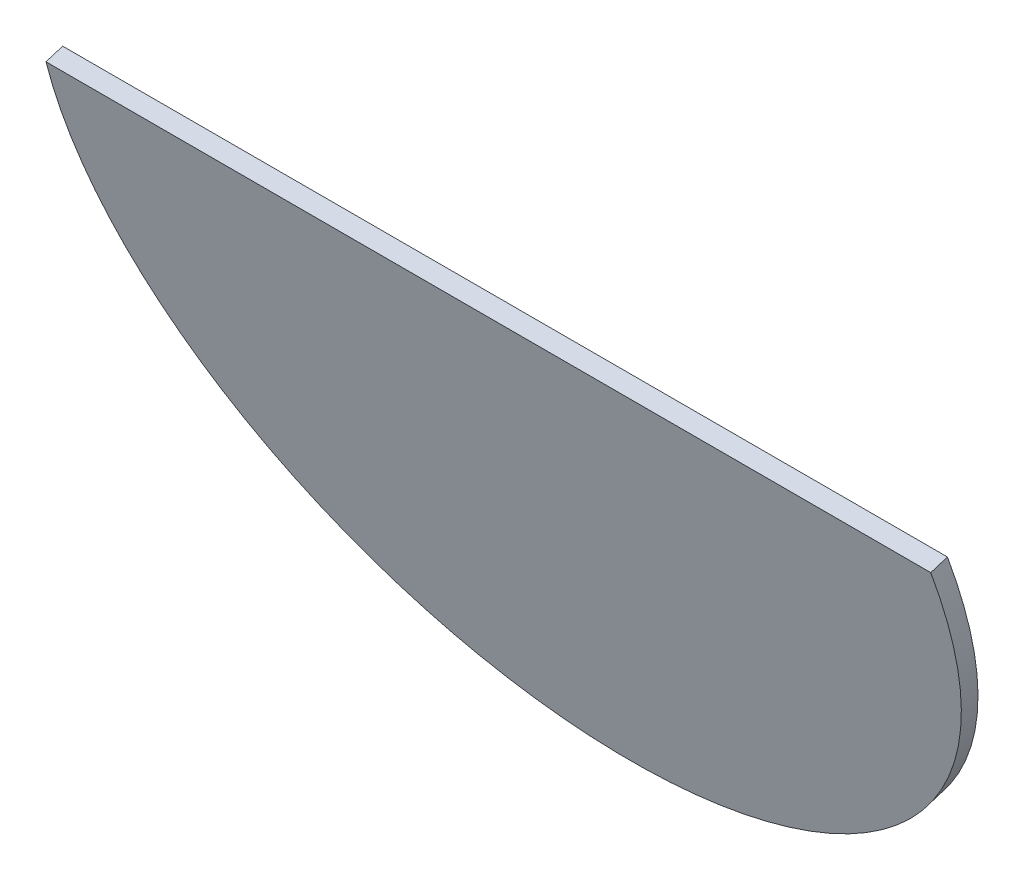
ISO-10303-21;
HEADER;
FILE_DESCRIPTION(('STEP AP214'),'2;1');
FILE_NAME('part.step','',(''),(''),'','','');
FILE_SCHEMA(('AUTOMOTIVE_DESIGN { 1 0 10303 214 1 1 1 1 }'));
ENDSEC;
DATA;
#1=APPLICATION_CONTEXT('core data for automotive mechanical design processes');
#2=APPLICATION_PROTOCOL_DEFINITION('international standard','automotive_design',2000,#1);
#3=PRODUCT_CONTEXT('',#1,'mechanical');
#4=PRODUCT('Part','Part','',(#3));
#5=PRODUCT_RELATED_PRODUCT_CATEGORY('part','',(#4));
#6=PRODUCT_DEFINITION_FORMATION('','',#4);
#7=PRODUCT_DEFINITION_CONTEXT('part definition',#1,'design');
#8=PRODUCT_DEFINITION('design','',#6,#7);
#9=PRODUCT_DEFINITION_SHAPE('','',#8);
#10=(LENGTH_UNIT() NAMED_UNIT(*) SI_UNIT(.MILLI.,.METRE.));
#11=(NAMED_UNIT(*) PLANE_ANGLE_UNIT() SI_UNIT($,.RADIAN.));
#12=(NAMED_UNIT(*) SI_UNIT($,.STERADIAN.) SOLID_ANGLE_UNIT());
#13=UNCERTAINTY_MEASURE_WITH_UNIT(LENGTH_MEASURE(1.E-05),#10,'distance_accuracy_value','');
#14=(GEOMETRIC_REPRESENTATION_CONTEXT(3) GLOBAL_UNCERTAINTY_ASSIGNED_CONTEXT((#13)) GLOBAL_UNIT_ASSIGNED_CONTEXT((#10,
#11,#12)) REPRESENTATION_CONTEXT('',''));
#15=CARTESIAN_POINT('',(0.,0.,0.));
#16=DIRECTION('',(0.,0.,1.));
#17=DIRECTION('',(1.,0.,0.));
#18=AXIS2_PLACEMENT_3D('',#15,#16,#17);
#19=CARTESIAN_POINT('',(95.5179,-317.703250931976,33.0611022683727));
#20=DIRECTION('',(0.,-0.298374534012254,0.954448865813654));
#21=DIRECTION('',(0.,-0.954448865813654,-0.298374534012254));
#22=AXIS2_PLACEMENT_3D('',#19,#20,#21);
#23=CYLINDRICAL_SURFACE('',#22,50.8);
#24=CARTESIAN_POINT('',(95.5179,-318.3,34.97));
#25=DIRECTION('',(0.,0.298374534012254,-0.954448865813654));
#26=DIRECTION('',(0.,0.954448865813654,0.298374534012254));
#27=AXIS2_PLACEMENT_3D('',#24,#25,#26);
#28=CIRCLE('',#27,50.8);
#29=CARTESIAN_POINT('',(146.173042945993,-314.641024310038,36.113848775517));
#30=VERTEX_POINT('',#29);
#31=CARTESIAN_POINT('',(44.8627570540067,-314.641024310038,36.113848775517));
#32=VERTEX_POINT('',#31);
#33=EDGE_CURVE('E73',#30,#32,#28,.T.);
#34=ORIENTED_EDGE('',*,*,#33,.T.);
#35=DIRECTION('',(0.,-0.298374534012254,0.954448865813654));
#36=VECTOR('',#35,1.);
#37=CARTESIAN_POINT('',(44.8627570540067,-314.044275242014,34.2049510438897));
#38=LINE('',#37,#36);
#39=CARTESIAN_POINT('',(44.8627570540067,-314.044275242014,34.2049510438897));
#40=VERTEX_POINT('',#39);
#41=EDGE_CURVE('E11',#40,#32,#38,.T.);
#42=ORIENTED_EDGE('',*,*,#41,.F.);
#43=CARTESIAN_POINT('',(95.5179,-317.703250931976,33.0611022683727));
#44=DIRECTION('',(0.,0.298374534012254,-0.954448865813654));
#45=DIRECTION('',(0.,0.954448865813654,0.298374534012254));
#46=AXIS2_PLACEMENT_3D('',#43,#44,#45);
#47=CIRCLE('',#46,50.8);
#48=CARTESIAN_POINT('',(146.173042945993,-314.044275242014,34.2049510438897));
#49=VERTEX_POINT('',#48);
#50=EDGE_CURVE('E72',#49,#40,#47,.T.);
#51=ORIENTED_EDGE('',*,*,#50,.F.);
#52=DIRECTION('',(0.,-0.298374534012254,0.954448865813654));
#53=VECTOR('',#52,1.);
#54=CARTESIAN_POINT('',(146.173042945993,-314.044275242014,34.2049510438897));
#55=LINE('',#54,#53);
#56=EDGE_CURVE('E49',#49,#30,#55,.T.);
#57=ORIENTED_EDGE('',*,*,#56,.T.);
#58=EDGE_LOOP('',(#34,#42,#51,#57));
#59=FACE_BOUND('',#58,.T.);
#60=ADVANCED_FACE('F40',(#59),#23,.T.);
#61=CARTESIAN_POINT('',(146.173042945993,-314.044275242014,34.2049510438897));
#62=DIRECTION('',(0.,-0.954448865813654,-0.298374534012254));
#63=DIRECTION('',(0.,0.298374534012254,-0.954448865813654));
#64=AXIS2_PLACEMENT_3D('',#61,#62,#63);
#65=PLANE('',#64);
#66=DIRECTION('',(1.,0.,0.));
#67=VECTOR('',#66,1.);
#68=CARTESIAN_POINT('',(146.173042945993,-314.641024310038,36.113848775517));
#69=LINE('',#68,#67);
#70=EDGE_CURVE('E64',#32,#30,#69,.T.);
#71=ORIENTED_EDGE('',*,*,#70,.T.);
#72=ORIENTED_EDGE('',*,*,#56,.F.);
#73=DIRECTION('',(1.,0.,0.));
#74=VECTOR('',#73,1.);
#75=CARTESIAN_POINT('',(146.173042945993,-314.044275242014,34.2049510438897));
#76=LINE('',#75,#74);
#77=EDGE_CURVE('E56',#40,#49,#76,.T.);
#78=ORIENTED_EDGE('',*,*,#77,.F.);
#79=ORIENTED_EDGE('',*,*,#41,.T.);
#80=EDGE_LOOP('',(#71,#72,#78,#79));
#81=FACE_BOUND('',#80,.T.);
#82=ADVANCED_FACE('F67',(#81),#65,.F.);
#83=CARTESIAN_POINT('',(95.5179,-317.703250931976,33.0611022683727));
#84=DIRECTION('',(0.,0.298374534012254,-0.954448865813654));
#85=DIRECTION('',(0.,0.954448865813654,0.298374534012254));
#86=AXIS2_PLACEMENT_3D('',#83,#84,#85);
#87=PLANE('',#86);
#88=ORIENTED_EDGE('',*,*,#50,.T.);
#89=ORIENTED_EDGE('',*,*,#77,.T.);
#90=EDGE_LOOP('',(#88,#89));
#91=FACE_BOUND('',#90,.T.);
#92=ADVANCED_FACE('F86',(#91),#87,.T.);
#93=CARTESIAN_POINT('',(95.5179,-318.3,34.97));
#94=DIRECTION('',(0.,0.298374534012254,-0.954448865813654));
#95=DIRECTION('',(0.,0.954448865813654,0.298374534012254));
#96=AXIS2_PLACEMENT_3D('',#93,#94,#95);
#97=PLANE('',#96);
#98=ORIENTED_EDGE('',*,*,#33,.F.);
#99=ORIENTED_EDGE('',*,*,#70,.F.);
#100=EDGE_LOOP('',(#98,#99));
#101=FACE_BOUND('',#100,.T.);
#102=ADVANCED_FACE('F77',(#101),#97,.F.);
#103=CLOSED_SHELL('',(#60,#82,#92,#102));
#104=MANIFOLD_SOLID_BREP('B2',#103);
#105=ADVANCED_BREP_SHAPE_REPRESENTATION('',(#18,#104),#14);
#106=SHAPE_DEFINITION_REPRESENTATION(#9,#105);
ENDSEC;
END-ISO-10303-21;
